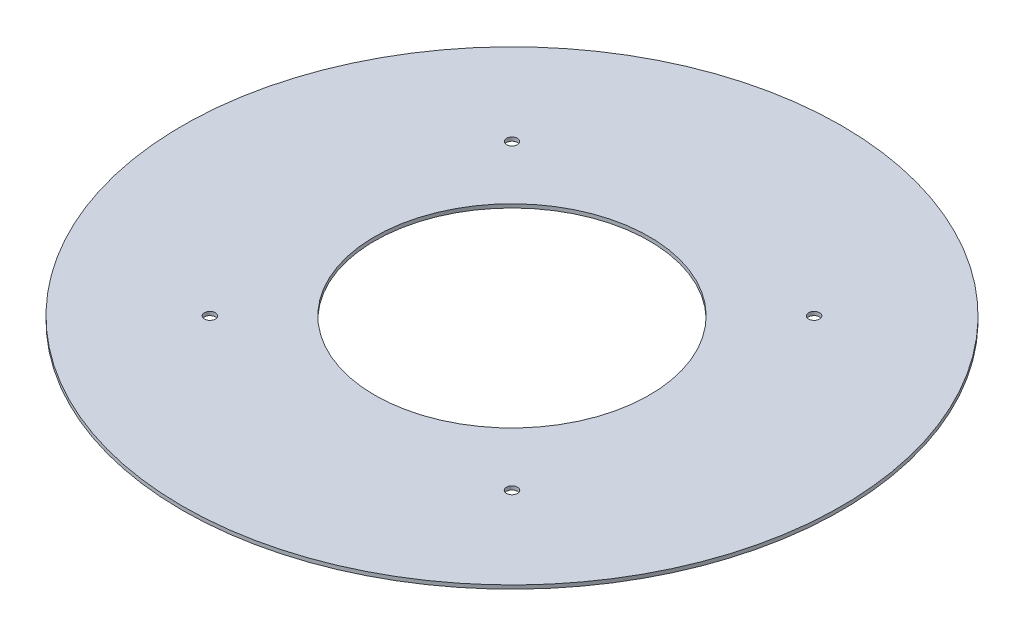
ISO-10303-21;
HEADER;
FILE_DESCRIPTION(('STEP AP214'),'2;1');
FILE_NAME('part.step','',(''),(''),'','','');
FILE_SCHEMA(('AUTOMOTIVE_DESIGN { 1 0 10303 214 1 1 1 1 }'));
ENDSEC;
DATA;
#1=APPLICATION_CONTEXT('core data for automotive mechanical design processes');
#2=APPLICATION_PROTOCOL_DEFINITION('international standard','automotive_design',2000,#1);
#3=PRODUCT_CONTEXT('',#1,'mechanical');
#4=PRODUCT('Part','Part','',(#3));
#5=PRODUCT_RELATED_PRODUCT_CATEGORY('part','',(#4));
#6=PRODUCT_DEFINITION_FORMATION('','',#4);
#7=PRODUCT_DEFINITION_CONTEXT('part definition',#1,'design');
#8=PRODUCT_DEFINITION('design','',#6,#7);
#9=PRODUCT_DEFINITION_SHAPE('','',#8);
#10=(LENGTH_UNIT() NAMED_UNIT(*) SI_UNIT(.MILLI.,.METRE.));
#11=(NAMED_UNIT(*) PLANE_ANGLE_UNIT() SI_UNIT($,.RADIAN.));
#12=(NAMED_UNIT(*) SI_UNIT($,.STERADIAN.) SOLID_ANGLE_UNIT());
#13=UNCERTAINTY_MEASURE_WITH_UNIT(LENGTH_MEASURE(1.E-05),#10,'distance_accuracy_value','');
#14=(GEOMETRIC_REPRESENTATION_CONTEXT(3) GLOBAL_UNCERTAINTY_ASSIGNED_CONTEXT((#13)) GLOBAL_UNIT_ASSIGNED_CONTEXT((#10,
#11,#12)) REPRESENTATION_CONTEXT('',''));
#15=CARTESIAN_POINT('',(0.,0.,0.));
#16=DIRECTION('',(0.,0.,1.));
#17=DIRECTION('',(1.,0.,0.));
#18=AXIS2_PLACEMENT_3D('',#15,#16,#17);
#19=CARTESIAN_POINT('',(0.,2.,0.));
#20=DIRECTION('',(0.,1.,0.));
#21=DIRECTION('',(0.,0.,1.));
#22=AXIS2_PLACEMENT_3D('',#19,#20,#21);
#23=PLANE('',#22);
#24=CARTESIAN_POINT('',(82.5,2.,82.5));
#25=DIRECTION('',(0.,1.,0.));
#26=DIRECTION('',(0.,0.,1.));
#27=AXIS2_PLACEMENT_3D('',#24,#25,#26);
#28=CIRCLE('',#27,3.00000000000001);
#29=CARTESIAN_POINT('',(82.5,2.,85.5));
#30=VERTEX_POINT('',#29);
#31=EDGE_CURVE('E69',#30,#30,#28,.T.);
#32=ORIENTED_EDGE('',*,*,#31,.F.);
#33=EDGE_LOOP('',(#32));
#34=FACE_BOUND('',#33,.T.);
#35=CARTESIAN_POINT('',(-82.5,2.,-82.5));
#36=DIRECTION('',(0.,1.,0.));
#37=DIRECTION('',(0.,0.,1.));
#38=AXIS2_PLACEMENT_3D('',#35,#36,#37);
#39=CIRCLE('',#38,3.00000000000001);
#40=CARTESIAN_POINT('',(-82.5,2.,-79.5));
#41=VERTEX_POINT('',#40);
#42=EDGE_CURVE('E57',#41,#41,#39,.T.);
#43=ORIENTED_EDGE('',*,*,#42,.F.);
#44=EDGE_LOOP('',(#43));
#45=FACE_BOUND('',#44,.T.);
#46=CARTESIAN_POINT('',(0.,2.,0.));
#47=DIRECTION('',(0.,1.,0.));
#48=DIRECTION('',(0.,0.,1.));
#49=AXIS2_PLACEMENT_3D('',#46,#47,#48);
#50=CIRCLE('',#49,180.);
#51=CARTESIAN_POINT('',(0.,2.,180.));
#52=VERTEX_POINT('',#51);
#53=EDGE_CURVE('E10',#52,#52,#50,.T.);
#54=ORIENTED_EDGE('',*,*,#53,.T.);
#55=EDGE_LOOP('',(#54));
#56=FACE_BOUND('',#55,.T.);
#57=CARTESIAN_POINT('',(0.,2.,0.));
#58=DIRECTION('',(0.,1.,0.));
#59=DIRECTION('',(0.,0.,1.));
#60=AXIS2_PLACEMENT_3D('',#57,#58,#59);
#61=CIRCLE('',#60,75.);
#62=CARTESIAN_POINT('',(0.,2.,75.));
#63=VERTEX_POINT('',#62);
#64=EDGE_CURVE('E52',#63,#63,#61,.T.);
#65=ORIENTED_EDGE('',*,*,#64,.F.);
#66=EDGE_LOOP('',(#65));
#67=FACE_BOUND('',#66,.T.);
#68=CARTESIAN_POINT('',(82.5,2.,-82.5));
#69=DIRECTION('',(0.,1.,0.));
#70=DIRECTION('',(0.,0.,1.));
#71=AXIS2_PLACEMENT_3D('',#68,#69,#70);
#72=CIRCLE('',#71,3.00000000000001);
#73=CARTESIAN_POINT('',(82.5,2.,-79.5));
#74=VERTEX_POINT('',#73);
#75=EDGE_CURVE('E63',#74,#74,#72,.T.);
#76=ORIENTED_EDGE('',*,*,#75,.F.);
#77=EDGE_LOOP('',(#76));
#78=FACE_BOUND('',#77,.T.);
#79=CARTESIAN_POINT('',(-82.5,2.,82.5));
#80=DIRECTION('',(0.,1.,0.));
#81=DIRECTION('',(0.,0.,1.));
#82=AXIS2_PLACEMENT_3D('',#79,#80,#81);
#83=CIRCLE('',#82,3.00000000000001);
#84=CARTESIAN_POINT('',(-82.5,2.,85.5));
#85=VERTEX_POINT('',#84);
#86=EDGE_CURVE('E75',#85,#85,#83,.T.);
#87=ORIENTED_EDGE('',*,*,#86,.F.);
#88=EDGE_LOOP('',(#87));
#89=FACE_BOUND('',#88,.T.);
#90=ADVANCED_FACE('F41',(#34,#45,#56,#67,#78,#89),#23,.T.);
#91=CARTESIAN_POINT('',(0.,0.,0.));
#92=DIRECTION('',(0.,1.,0.));
#93=DIRECTION('',(0.,0.,1.));
#94=AXIS2_PLACEMENT_3D('',#91,#92,#93);
#95=PLANE('',#94);
#96=CARTESIAN_POINT('',(0.,0.,0.));
#97=DIRECTION('',(0.,1.,0.));
#98=DIRECTION('',(0.,0.,1.));
#99=AXIS2_PLACEMENT_3D('',#96,#97,#98);
#100=CIRCLE('',#99,180.);
#101=CARTESIAN_POINT('',(0.,0.,180.));
#102=VERTEX_POINT('',#101);
#103=EDGE_CURVE('E45',#102,#102,#100,.T.);
#104=ORIENTED_EDGE('',*,*,#103,.F.);
#105=EDGE_LOOP('',(#104));
#106=FACE_BOUND('',#105,.T.);
#107=CARTESIAN_POINT('',(0.,0.,0.));
#108=DIRECTION('',(0.,1.,0.));
#109=DIRECTION('',(0.,0.,1.));
#110=AXIS2_PLACEMENT_3D('',#107,#108,#109);
#111=CIRCLE('',#110,75.);
#112=CARTESIAN_POINT('',(0.,0.,75.));
#113=VERTEX_POINT('',#112);
#114=EDGE_CURVE('E54',#113,#113,#111,.T.);
#115=ORIENTED_EDGE('',*,*,#114,.T.);
#116=EDGE_LOOP('',(#115));
#117=FACE_BOUND('',#116,.T.);
#118=CARTESIAN_POINT('',(-82.5,0.,-82.5));
#119=DIRECTION('',(0.,1.,0.));
#120=DIRECTION('',(0.,0.,1.));
#121=AXIS2_PLACEMENT_3D('',#118,#119,#120);
#122=CIRCLE('',#121,3.00000000000001);
#123=CARTESIAN_POINT('',(-82.5,0.,-79.5));
#124=VERTEX_POINT('',#123);
#125=EDGE_CURVE('E60',#124,#124,#122,.T.);
#126=ORIENTED_EDGE('',*,*,#125,.T.);
#127=EDGE_LOOP('',(#126));
#128=FACE_BOUND('',#127,.T.);
#129=CARTESIAN_POINT('',(82.5,0.,-82.5));
#130=DIRECTION('',(0.,1.,0.));
#131=DIRECTION('',(0.,0.,1.));
#132=AXIS2_PLACEMENT_3D('',#129,#130,#131);
#133=CIRCLE('',#132,3.00000000000001);
#134=CARTESIAN_POINT('',(82.5,0.,-79.5));
#135=VERTEX_POINT('',#134);
#136=EDGE_CURVE('E66',#135,#135,#133,.T.);
#137=ORIENTED_EDGE('',*,*,#136,.T.);
#138=EDGE_LOOP('',(#137));
#139=FACE_BOUND('',#138,.T.);
#140=CARTESIAN_POINT('',(82.5,0.,82.5));
#141=DIRECTION('',(0.,1.,0.));
#142=DIRECTION('',(0.,0.,1.));
#143=AXIS2_PLACEMENT_3D('',#140,#141,#142);
#144=CIRCLE('',#143,3.00000000000001);
#145=CARTESIAN_POINT('',(82.5,0.,85.5));
#146=VERTEX_POINT('',#145);
#147=EDGE_CURVE('E72',#146,#146,#144,.T.);
#148=ORIENTED_EDGE('',*,*,#147,.T.);
#149=EDGE_LOOP('',(#148));
#150=FACE_BOUND('',#149,.T.);
#151=CARTESIAN_POINT('',(-82.5,0.,82.5));
#152=DIRECTION('',(0.,1.,0.));
#153=DIRECTION('',(0.,0.,1.));
#154=AXIS2_PLACEMENT_3D('',#151,#152,#153);
#155=CIRCLE('',#154,3.00000000000001);
#156=CARTESIAN_POINT('',(-82.5,0.,85.5));
#157=VERTEX_POINT('',#156);
#158=EDGE_CURVE('E78',#157,#157,#155,.T.);
#159=ORIENTED_EDGE('',*,*,#158,.T.);
#160=EDGE_LOOP('',(#159));
#161=FACE_BOUND('',#160,.T.);
#162=ADVANCED_FACE('F88',(#106,#117,#128,#139,#150,#161),#95,.F.);
#163=CARTESIAN_POINT('',(0.,2.,0.));
#164=DIRECTION('',(0.,-1.,0.));
#165=DIRECTION('',(0.,0.,-1.));
#166=AXIS2_PLACEMENT_3D('',#163,#164,#165);
#167=CYLINDRICAL_SURFACE('',#166,180.);
#168=ORIENTED_EDGE('',*,*,#53,.F.);
#169=EDGE_LOOP('',(#168));
#170=FACE_BOUND('',#169,.T.);
#171=ORIENTED_EDGE('',*,*,#103,.T.);
#172=EDGE_LOOP('',(#171));
#173=FACE_BOUND('',#172,.T.);
#174=ADVANCED_FACE('F43',(#170,#173),#167,.T.);
#175=CARTESIAN_POINT('',(0.,2.,0.));
#176=DIRECTION('',(0.,-1.,0.));
#177=DIRECTION('',(0.,0.,-1.));
#178=AXIS2_PLACEMENT_3D('',#175,#176,#177);
#179=CYLINDRICAL_SURFACE('',#178,75.);
#180=ORIENTED_EDGE('',*,*,#64,.T.);
#181=EDGE_LOOP('',(#180));
#182=FACE_BOUND('',#181,.T.);
#183=ORIENTED_EDGE('',*,*,#114,.F.);
#184=EDGE_LOOP('',(#183));
#185=FACE_BOUND('',#184,.T.);
#186=ADVANCED_FACE('F98',(#182,#185),#179,.F.);
#187=CARTESIAN_POINT('',(-82.5,2.,-82.5));
#188=DIRECTION('',(0.,-1.,0.));
#189=DIRECTION('',(0.,0.,-1.));
#190=AXIS2_PLACEMENT_3D('',#187,#188,#189);
#191=CYLINDRICAL_SURFACE('',#190,3.00000000000001);
#192=ORIENTED_EDGE('',*,*,#42,.T.);
#193=EDGE_LOOP('',(#192));
#194=FACE_BOUND('',#193,.T.);
#195=ORIENTED_EDGE('',*,*,#125,.F.);
#196=EDGE_LOOP('',(#195));
#197=FACE_BOUND('',#196,.T.);
#198=ADVANCED_FACE('F101',(#194,#197),#191,.F.);
#199=CARTESIAN_POINT('',(82.5,2.,-82.5));
#200=DIRECTION('',(0.,-1.,0.));
#201=DIRECTION('',(0.,0.,-1.));
#202=AXIS2_PLACEMENT_3D('',#199,#200,#201);
#203=CYLINDRICAL_SURFACE('',#202,3.00000000000001);
#204=ORIENTED_EDGE('',*,*,#75,.T.);
#205=EDGE_LOOP('',(#204));
#206=FACE_BOUND('',#205,.T.);
#207=ORIENTED_EDGE('',*,*,#136,.F.);
#208=EDGE_LOOP('',(#207));
#209=FACE_BOUND('',#208,.T.);
#210=ADVANCED_FACE('F105',(#206,#209),#203,.F.);
#211=CARTESIAN_POINT('',(82.5,2.,82.5));
#212=DIRECTION('',(0.,-1.,0.));
#213=DIRECTION('',(0.,0.,-1.));
#214=AXIS2_PLACEMENT_3D('',#211,#212,#213);
#215=CYLINDRICAL_SURFACE('',#214,3.00000000000001);
#216=ORIENTED_EDGE('',*,*,#31,.T.);
#217=EDGE_LOOP('',(#216));
#218=FACE_BOUND('',#217,.T.);
#219=ORIENTED_EDGE('',*,*,#147,.F.);
#220=EDGE_LOOP('',(#219));
#221=FACE_BOUND('',#220,.T.);
#222=ADVANCED_FACE('F109',(#218,#221),#215,.F.);
#223=CARTESIAN_POINT('',(-82.5,2.,82.5));
#224=DIRECTION('',(0.,-1.,0.));
#225=DIRECTION('',(0.,0.,-1.));
#226=AXIS2_PLACEMENT_3D('',#223,#224,#225);
#227=CYLINDRICAL_SURFACE('',#226,3.00000000000001);
#228=ORIENTED_EDGE('',*,*,#86,.T.);
#229=EDGE_LOOP('',(#228));
#230=FACE_BOUND('',#229,.T.);
#231=ORIENTED_EDGE('',*,*,#158,.F.);
#232=EDGE_LOOP('',(#231));
#233=FACE_BOUND('',#232,.T.);
#234=ADVANCED_FACE('F84',(#230,#233),#227,.F.);
#235=CLOSED_SHELL('',(#90,#162,#174,#186,#198,#210,#222,#234));
#236=MANIFOLD_SOLID_BREP('B2',#235);
#237=ADVANCED_BREP_SHAPE_REPRESENTATION('',(#18,#236),#14);
#238=SHAPE_DEFINITION_REPRESENTATION(#9,#237);
ENDSEC;
END-ISO-10303-21;
